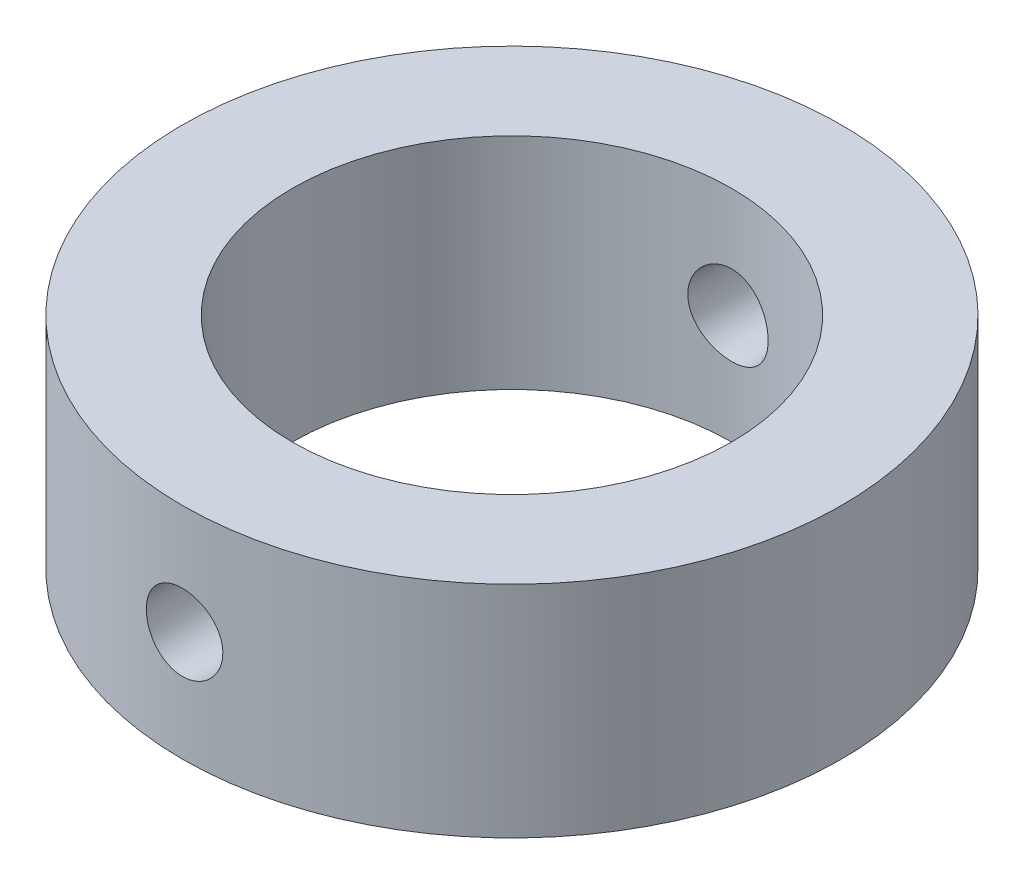
ISO-10303-21;
HEADER;
FILE_DESCRIPTION(('STEP AP214'),'2;1');
FILE_NAME('part.step','',(''),(''),'','','');
FILE_SCHEMA(('AUTOMOTIVE_DESIGN { 1 0 10303 214 1 1 1 1 }'));
ENDSEC;
DATA;
#1=APPLICATION_CONTEXT('core data for automotive mechanical design processes');
#2=APPLICATION_PROTOCOL_DEFINITION('international standard','automotive_design',2000,#1);
#3=PRODUCT_CONTEXT('',#1,'mechanical');
#4=PRODUCT('Part','Part','',(#3));
#5=PRODUCT_RELATED_PRODUCT_CATEGORY('part','',(#4));
#6=PRODUCT_DEFINITION_FORMATION('','',#4);
#7=PRODUCT_DEFINITION_CONTEXT('part definition',#1,'design');
#8=PRODUCT_DEFINITION('design','',#6,#7);
#9=PRODUCT_DEFINITION_SHAPE('','',#8);
#10=(LENGTH_UNIT() NAMED_UNIT(*) SI_UNIT(.MILLI.,.METRE.));
#11=(NAMED_UNIT(*) PLANE_ANGLE_UNIT() SI_UNIT($,.RADIAN.));
#12=(NAMED_UNIT(*) SI_UNIT($,.STERADIAN.) SOLID_ANGLE_UNIT());
#13=UNCERTAINTY_MEASURE_WITH_UNIT(LENGTH_MEASURE(1.E-05),#10,'distance_accuracy_value','');
#14=(GEOMETRIC_REPRESENTATION_CONTEXT(3) GLOBAL_UNCERTAINTY_ASSIGNED_CONTEXT((#13)) GLOBAL_UNIT_ASSIGNED_CONTEXT((#10,
#11,#12)) REPRESENTATION_CONTEXT('',''));
#15=CARTESIAN_POINT('',(0.,0.,0.));
#16=DIRECTION('',(0.,0.,1.));
#17=DIRECTION('',(1.,0.,0.));
#18=AXIS2_PLACEMENT_3D('',#15,#16,#17);
#19=CARTESIAN_POINT('',(0.,10.,0.));
#20=DIRECTION('',(0.,-1.,0.));
#21=DIRECTION('',(0.,0.,-1.));
#22=AXIS2_PLACEMENT_3D('',#19,#20,#21);
#23=CYLINDRICAL_SURFACE('',#22,15.);
#24=CARTESIAN_POINT('',(-1.25139295982516,3.79234175910093,-14.9477093783663));
#25=CARTESIAN_POINT('',(-1.18348361730633,3.72212170808379,-14.9533941423082));
#26=CARTESIAN_POINT('',(-1.10960235790619,3.6575922402065,-14.959111755429));
#27=CARTESIAN_POINT('',(-0.951974794354079,3.54178217258282,-14.9699694142824));
#28=CARTESIAN_POINT('',(-0.868218042358172,3.49051579105574,-14.9751088368794));
#29=CARTESIAN_POINT('',(-0.693247842293825,3.40275674603921,-14.9842273422935));
#30=CARTESIAN_POINT('',(-0.602036163469136,3.3662605893661,-14.9882066994057));
#31=CARTESIAN_POINT('',(-0.414751314196763,3.30909945416944,-14.9945574031471));
#32=CARTESIAN_POINT('',(-0.318679383136366,3.28843046112193,-14.9969291575235));
#33=CARTESIAN_POINT('',(-0.124759031234632,3.26356199226369,-14.9997933721163));
#34=CARTESIAN_POINT('',(-0.0269184568573645,3.25930213639594,-15.0002927219653));
#35=CARTESIAN_POINT('',(0.16808929344199,3.26721159114971,-14.9993751227787));
#36=CARTESIAN_POINT('',(0.265256456118352,3.27938122401569,-14.9979581361564));
#37=CARTESIAN_POINT('',(0.455867685818328,3.31973244627101,-14.9933736118058));
#38=CARTESIAN_POINT('',(0.549321687730372,3.34786772715315,-14.9902111376025));
#39=CARTESIAN_POINT('',(0.730179766945123,3.41930303345223,-14.9824910433732));
#40=CARTESIAN_POINT('',(0.817583693993111,3.46260343533601,-14.9779333887128));
#41=CARTESIAN_POINT('',(0.984231942669029,3.56333708096608,-14.9679087365019));
#42=CARTESIAN_POINT('',(1.06344352003794,3.62082414781445,-14.9624383021489));
#43=CARTESIAN_POINT('',(1.21111707847543,3.74823462943925,-14.951210323341));
#44=CARTESIAN_POINT('',(1.27957874220067,3.81815841122443,-14.9454527704169));
#45=CARTESIAN_POINT('',(1.40410151674721,3.96882162024619,-14.9342704617429));
#46=CARTESIAN_POINT('',(1.46010888833959,4.04960559371394,-14.9288472185055));
#47=CARTESIAN_POINT('',(1.55774721151655,4.21949419344744,-14.9189758942557));
#48=CARTESIAN_POINT('',(1.59937843598775,4.30859866173358,-14.9145277947339));
#49=CARTESIAN_POINT('',(1.66694770508925,4.49233378848272,-14.9071273153428));
#50=CARTESIAN_POINT('',(1.69293157765381,4.58694741024729,-14.9041705717653));
#51=CARTESIAN_POINT('',(1.72862325500614,4.77923330987449,-14.9000734640334));
#52=CARTESIAN_POINT('',(1.73833182037575,4.8769054445886,-14.8989330149997));
#53=CARTESIAN_POINT('',(1.74117284808901,5.07183886272726,-14.8986012331248));
#54=CARTESIAN_POINT('',(1.73441556498063,5.16909853447988,-14.8993969358513));
#55=CARTESIAN_POINT('',(1.70475746381206,5.36108970975458,-14.9028192383814));
#56=CARTESIAN_POINT('',(1.68185671328854,5.45582122385157,-14.9054458305255));
#57=CARTESIAN_POINT('',(1.62060790126855,5.64001650606758,-14.9122289191979));
#58=CARTESIAN_POINT('',(1.58227054612305,5.72948387604308,-14.9163843551955));
#59=CARTESIAN_POINT('',(1.49125204534761,5.90073691298411,-14.9257579755586));
#60=CARTESIAN_POINT('',(1.43857032350961,5.98252227118844,-14.9309762026139));
#61=CARTESIAN_POINT('',(1.31997142180831,6.13664566492841,-14.9419287020573));
#62=CARTESIAN_POINT('',(1.25397289961079,6.20892089469088,-14.9476660202061));
#63=CARTESIAN_POINT('',(1.11079906305098,6.34140862329275,-14.9589863094882));
#64=CARTESIAN_POINT('',(1.03362345146268,6.40162080124472,-14.9645692765121));
#65=CARTESIAN_POINT('',(0.869904556181986,6.5085191472905,-14.974979503484));
#66=CARTESIAN_POINT('',(0.783323829486855,6.55514831204156,-14.9798035406217));
#67=CARTESIAN_POINT('',(0.603502076418399,6.63320584636191,-14.988124547744));
#68=CARTESIAN_POINT('',(0.510261214407792,6.66463459090741,-14.9916215504644));
#69=CARTESIAN_POINT('',(0.320094647848075,6.71129490261493,-14.9968847357431));
#70=CARTESIAN_POINT('',(0.223182331271785,6.72658036779918,-14.9986566762557));
#71=CARTESIAN_POINT('',(0.0281521221882949,6.74068866480036,-15.0002904884823));
#72=CARTESIAN_POINT('',(-0.0699657338356353,6.73951199359127,-15.0001524178573));
#73=CARTESIAN_POINT('',(-0.264148103670457,6.72077552612079,-14.9979869929609));
#74=CARTESIAN_POINT('',(-0.360219946569306,6.70329054732366,-14.9959682666052));
#75=CARTESIAN_POINT('',(-0.548054285042728,6.65255550994882,-14.9902792132202));
#76=CARTESIAN_POINT('',(-0.639816726227135,6.61930525245185,-14.9866088653515));
#77=CARTESIAN_POINT('',(-0.816621649027737,6.53792082135768,-14.9780167341074));
#78=CARTESIAN_POINT('',(-0.901651652460339,6.48975978658742,-14.9730926951241));
#79=CARTESIAN_POINT('',(-1.06244337638185,6.37993338561684,-14.9625437725082));
#80=CARTESIAN_POINT('',(-1.13820473714439,6.31826749553701,-14.9569188616911));
#81=CARTESIAN_POINT('',(-1.27872233792701,6.1827917076007,-14.9455637068463));
#82=CARTESIAN_POINT('',(-1.34341904597503,6.10892007797831,-14.9398330661667));
#83=CARTESIAN_POINT('',(-1.45949320861428,5.95132491462382,-14.9289413127772));
#84=CARTESIAN_POINT('',(-1.51087064696238,5.86760136887729,-14.9237802007618));
#85=CARTESIAN_POINT('',(-1.598817721295,5.69267241777389,-14.9146151690913));
#86=CARTESIAN_POINT('',(-1.63539104756275,5.60146888381067,-14.9106109611211));
#87=CARTESIAN_POINT('',(-1.69266858688715,5.41415783089962,-14.9042178844545));
#88=CARTESIAN_POINT('',(-1.71337406162808,5.31805070249455,-14.9018288873311));
#89=CARTESIAN_POINT('',(-1.73821662730021,5.12433738632427,-14.8989516677065));
#90=CARTESIAN_POINT('',(-1.74246223611426,5.02674529041029,-14.8984509963019));
#91=CARTESIAN_POINT('',(-1.73455547426127,4.83221556777059,-14.8993735525888));
#92=CARTESIAN_POINT('',(-1.72239995165834,4.73527807044268,-14.9007971500824));
#93=CARTESIAN_POINT('',(-1.68211758918857,4.54514724373548,-14.9053978494331));
#94=CARTESIAN_POINT('',(-1.65403991262629,4.45194333009076,-14.9085695527698));
#95=CARTESIAN_POINT('',(-1.58278228057826,4.27163951697975,-14.9163023191482));
#96=CARTESIAN_POINT('',(-1.53961764849423,4.18453353135842,-14.9208619718838));
#97=CARTESIAN_POINT('',(-1.45582105008805,4.04585353510098,-14.9292238727328));
#98=CARTESIAN_POINT('',(-1.41895050934156,3.99195313575082,-14.9327884781705));
#99=CARTESIAN_POINT('',(-1.33940488728118,3.88863695862405,-14.9401336339009));
#100=CARTESIAN_POINT('',(-1.29672976569968,3.83922121196238,-14.9439141856915));
#101=CARTESIAN_POINT('',(-1.25139295982516,3.79234175910093,-14.9477093783663));
#102=B_SPLINE_CURVE_WITH_KNOTS('',3,(#24,#25,#26,#27,#28,#29,#30,#31,#32,#33,#34,#35,#36,#37,
#38,#39,#40,#41,#42,#43,#44,#45,#46,#47,#48,#49,#50,#51,#52,#53,#54,#55,#56,#57,#58,#59,#60,#61,
#62,#63,#64,#65,#66,#67,#68,#69,#70,#71,#72,#73,#74,#75,#76,#77,#78,#79,#80,#81,#82,#83,#84,#85,
#86,#87,#88,#89,#90,#91,#92,#93,#94,#95,#96,#97,#98,#99,#100,#101),.UNSPECIFIED.,.T.,.F.,(4,2,2,
2,2,2,2,2,2,2,2,2,2,2,2,2,2,2,2,2,2,2,2,2,2,2,2,2,2,2,2,2,2,2,2,2,2,2,4),(0.,0.293316909855174,
0.586946968764636,0.880507543020068,1.17399363161817,1.4663987535875,1.75880961081172,
2.05037663139753,2.3419508905076,2.63464884055526,2.92735542958346,3.22130151853812,
3.51524202752979,3.8083174033038,4.10137908262223,4.39248383339477,4.68358736632918,
4.97448934568743,5.26540301219817,5.558150589215,5.85090595253263,6.14487277299274,
6.43883234127234,6.73180732543656,7.02477346502405,7.31640214310492,7.60803450092443,
7.90019531018905,8.19236745494599,8.486065255112,8.77976341344675,9.073388315255,
9.36698986794301,9.6586524165134,9.95037102418017,10.2411937503675,10.5317219502416,
10.727541244806,10.9233618978793),.UNSPECIFIED.);
#103=CARTESIAN_POINT('',(-1.25139295982516,3.79234175910093,-14.9477093783663));
#104=VERTEX_POINT('',#103);
#105=EDGE_CURVE('E69',#104,#104,#102,.T.);
#106=ORIENTED_EDGE('',*,*,#105,.T.);
#107=EDGE_LOOP('',(#106));
#108=FACE_BOUND('',#107,.T.);
#109=CARTESIAN_POINT('',(0.,10.,0.));
#110=DIRECTION('',(0.,1.,0.));
#111=DIRECTION('',(0.,0.,1.));
#112=AXIS2_PLACEMENT_3D('',#109,#110,#111);
#113=CIRCLE('',#112,15.);
#114=CARTESIAN_POINT('',(0.,10.,15.));
#115=VERTEX_POINT('',#114);
#116=EDGE_CURVE('E10',#115,#115,#113,.T.);
#117=ORIENTED_EDGE('',*,*,#116,.F.);
#118=EDGE_LOOP('',(#117));
#119=FACE_BOUND('',#118,.T.);
#120=CARTESIAN_POINT('',(0.,0.,0.));
#121=DIRECTION('',(0.,1.,0.));
#122=DIRECTION('',(0.,0.,1.));
#123=AXIS2_PLACEMENT_3D('',#120,#121,#122);
#124=CIRCLE('',#123,15.);
#125=CARTESIAN_POINT('',(0.,0.,15.));
#126=VERTEX_POINT('',#125);
#127=EDGE_CURVE('E51',#126,#126,#124,.T.);
#128=ORIENTED_EDGE('',*,*,#127,.T.);
#129=EDGE_LOOP('',(#128));
#130=FACE_BOUND('',#129,.T.);
#131=CARTESIAN_POINT('',(-1.25139295982516,3.79234175910093,14.9477093783663));
#132=CARTESIAN_POINT('',(-1.18348361730633,3.72212170808379,14.9533941423082));
#133=CARTESIAN_POINT('',(-1.10960235790619,3.6575922402065,14.959111755429));
#134=CARTESIAN_POINT('',(-0.951974794354079,3.54178217258282,14.9699694142824));
#135=CARTESIAN_POINT('',(-0.868218042358172,3.49051579105574,14.9751088368794));
#136=CARTESIAN_POINT('',(-0.693247842293825,3.40275674603921,14.9842273422935));
#137=CARTESIAN_POINT('',(-0.602036163469136,3.3662605893661,14.9882066994057));
#138=CARTESIAN_POINT('',(-0.414751314196763,3.30909945416944,14.9945574031471));
#139=CARTESIAN_POINT('',(-0.318679383136366,3.28843046112193,14.9969291575235));
#140=CARTESIAN_POINT('',(-0.124759031234632,3.26356199226369,14.9997933721163));
#141=CARTESIAN_POINT('',(-0.0269184568573645,3.25930213639594,15.0002927219653));
#142=CARTESIAN_POINT('',(0.16808929344199,3.26721159114971,14.9993751227787));
#143=CARTESIAN_POINT('',(0.265256456118352,3.27938122401569,14.9979581361564));
#144=CARTESIAN_POINT('',(0.455867685818328,3.31973244627101,14.9933736118058));
#145=CARTESIAN_POINT('',(0.549321687730372,3.34786772715315,14.9902111376025));
#146=CARTESIAN_POINT('',(0.730179766945123,3.41930303345223,14.9824910433732));
#147=CARTESIAN_POINT('',(0.817583693993111,3.46260343533601,14.9779333887128));
#148=CARTESIAN_POINT('',(0.984231942669029,3.56333708096608,14.9679087365019));
#149=CARTESIAN_POINT('',(1.06344352003794,3.62082414781445,14.9624383021489));
#150=CARTESIAN_POINT('',(1.21111707847543,3.74823462943925,14.951210323341));
#151=CARTESIAN_POINT('',(1.27957874220067,3.81815841122443,14.9454527704169));
#152=CARTESIAN_POINT('',(1.40410151674721,3.96882162024619,14.9342704617429));
#153=CARTESIAN_POINT('',(1.46010888833959,4.04960559371394,14.9288472185055));
#154=CARTESIAN_POINT('',(1.55774721151655,4.21949419344744,14.9189758942557));
#155=CARTESIAN_POINT('',(1.59937843598775,4.30859866173358,14.9145277947339));
#156=CARTESIAN_POINT('',(1.66694770508925,4.49233378848272,14.9071273153428));
#157=CARTESIAN_POINT('',(1.69293157765381,4.58694741024729,14.9041705717653));
#158=CARTESIAN_POINT('',(1.72862325500614,4.77923330987449,14.9000734640334));
#159=CARTESIAN_POINT('',(1.73833182037575,4.8769054445886,14.8989330149997));
#160=CARTESIAN_POINT('',(1.74117284808901,5.07183886272726,14.8986012331248));
#161=CARTESIAN_POINT('',(1.73441556498063,5.16909853447988,14.8993969358513));
#162=CARTESIAN_POINT('',(1.70475746381206,5.36108970975458,14.9028192383814));
#163=CARTESIAN_POINT('',(1.68185671328854,5.45582122385157,14.9054458305255));
#164=CARTESIAN_POINT('',(1.62060790126855,5.64001650606758,14.9122289191979));
#165=CARTESIAN_POINT('',(1.58227054612305,5.72948387604308,14.9163843551955));
#166=CARTESIAN_POINT('',(1.49125204534761,5.90073691298411,14.9257579755586));
#167=CARTESIAN_POINT('',(1.43857032350961,5.98252227118844,14.9309762026139));
#168=CARTESIAN_POINT('',(1.31997142180831,6.13664566492841,14.9419287020573));
#169=CARTESIAN_POINT('',(1.25397289961079,6.20892089469088,14.9476660202061));
#170=CARTESIAN_POINT('',(1.11079906305098,6.34140862329275,14.9589863094882));
#171=CARTESIAN_POINT('',(1.03362345146268,6.40162080124472,14.9645692765121));
#172=CARTESIAN_POINT('',(0.869904556181986,6.5085191472905,14.974979503484));
#173=CARTESIAN_POINT('',(0.783323829486855,6.55514831204156,14.9798035406217));
#174=CARTESIAN_POINT('',(0.603502076418399,6.63320584636191,14.988124547744));
#175=CARTESIAN_POINT('',(0.510261214407792,6.66463459090741,14.9916215504644));
#176=CARTESIAN_POINT('',(0.320094647848075,6.71129490261493,14.9968847357431));
#177=CARTESIAN_POINT('',(0.223182331271785,6.72658036779918,14.9986566762557));
#178=CARTESIAN_POINT('',(0.0281521221882949,6.74068866480036,15.0002904884823));
#179=CARTESIAN_POINT('',(-0.0699657338356353,6.73951199359127,15.0001524178573));
#180=CARTESIAN_POINT('',(-0.264148103670457,6.72077552612079,14.9979869929609));
#181=CARTESIAN_POINT('',(-0.360219946569306,6.70329054732366,14.9959682666052));
#182=CARTESIAN_POINT('',(-0.548054285042728,6.65255550994882,14.9902792132202));
#183=CARTESIAN_POINT('',(-0.639816726227135,6.61930525245185,14.9866088653515));
#184=CARTESIAN_POINT('',(-0.816621649027737,6.53792082135768,14.9780167341074));
#185=CARTESIAN_POINT('',(-0.901651652460339,6.48975978658742,14.9730926951241));
#186=CARTESIAN_POINT('',(-1.06244337638185,6.37993338561684,14.9625437725082));
#187=CARTESIAN_POINT('',(-1.13820473714439,6.31826749553701,14.9569188616911));
#188=CARTESIAN_POINT('',(-1.27872233792701,6.1827917076007,14.9455637068463));
#189=CARTESIAN_POINT('',(-1.34341904597503,6.10892007797831,14.9398330661667));
#190=CARTESIAN_POINT('',(-1.45949320861428,5.95132491462382,14.9289413127772));
#191=CARTESIAN_POINT('',(-1.51087064696238,5.86760136887729,14.9237802007618));
#192=CARTESIAN_POINT('',(-1.598817721295,5.69267241777389,14.9146151690913));
#193=CARTESIAN_POINT('',(-1.63539104756275,5.60146888381067,14.9106109611211));
#194=CARTESIAN_POINT('',(-1.69266858688715,5.41415783089962,14.9042178844545));
#195=CARTESIAN_POINT('',(-1.71337406162808,5.31805070249455,14.9018288873311));
#196=CARTESIAN_POINT('',(-1.73821662730021,5.12433738632427,14.8989516677065));
#197=CARTESIAN_POINT('',(-1.74246223611426,5.02674529041029,14.8984509963019));
#198=CARTESIAN_POINT('',(-1.73455547426127,4.83221556777059,14.8993735525888));
#199=CARTESIAN_POINT('',(-1.72239995165834,4.73527807044268,14.9007971500824));
#200=CARTESIAN_POINT('',(-1.68211758918857,4.54514724373548,14.9053978494331));
#201=CARTESIAN_POINT('',(-1.65403991262629,4.45194333009076,14.9085695527698));
#202=CARTESIAN_POINT('',(-1.58278228057826,4.27163951697975,14.9163023191482));
#203=CARTESIAN_POINT('',(-1.53961764849423,4.18453353135842,14.9208619718838));
#204=CARTESIAN_POINT('',(-1.45582105008805,4.04585353510098,14.9292238727328));
#205=CARTESIAN_POINT('',(-1.41895050934156,3.99195313575082,14.9327884781705));
#206=CARTESIAN_POINT('',(-1.33940488728118,3.88863695862405,14.9401336339009));
#207=CARTESIAN_POINT('',(-1.29672976569968,3.83922121196238,14.9439141856915));
#208=CARTESIAN_POINT('',(-1.25139295982516,3.79234175910093,14.9477093783663));
#209=B_SPLINE_CURVE_WITH_KNOTS('',3,(#131,#132,#133,#134,#135,#136,#137,#138,#139,#140,#141,
#142,#143,#144,#145,#146,#147,#148,#149,#150,#151,#152,#153,#154,#155,#156,#157,#158,#159,#160,
#161,#162,#163,#164,#165,#166,#167,#168,#169,#170,#171,#172,#173,#174,#175,#176,#177,#178,#179,
#180,#181,#182,#183,#184,#185,#186,#187,#188,#189,#190,#191,#192,#193,#194,#195,#196,#197,#198,
#199,#200,#201,#202,#203,#204,#205,#206,#207,#208),.UNSPECIFIED.,.T.,.F.,(4,2,2,2,2,2,2,2,2,2,2,
2,2,2,2,2,2,2,2,2,2,2,2,2,2,2,2,2,2,2,2,2,2,2,2,2,2,2,4),(0.,0.293316909855174,
0.586946968764636,0.880507543020068,1.17399363161817,1.4663987535875,1.75880961081172,
2.05037663139753,2.3419508905076,2.63464884055526,2.92735542958346,3.22130151853812,
3.51524202752979,3.8083174033038,4.10137908262223,4.39248383339477,4.68358736632918,
4.97448934568743,5.26540301219817,5.558150589215,5.85090595253263,6.14487277299274,
6.43883234127234,6.73180732543656,7.02477346502405,7.31640214310492,7.60803450092443,
7.90019531018905,8.19236745494599,8.486065255112,8.77976341344675,9.073388315255,
9.36698986794301,9.6586524165134,9.95037102418017,10.2411937503675,10.5317219502416,
10.727541244806,10.9233618978793),.UNSPECIFIED.);
#210=CARTESIAN_POINT('',(-1.25139295982516,3.79234175910093,14.9477093783663));
#211=VERTEX_POINT('',#210);
#212=EDGE_CURVE('E88',#211,#211,#209,.T.);
#213=ORIENTED_EDGE('',*,*,#212,.F.);
#214=EDGE_LOOP('',(#213));
#215=FACE_BOUND('',#214,.T.);
#216=ADVANCED_FACE('F37',(#108,#119,#130,#215),#23,.T.);
#217=CARTESIAN_POINT('',(0.,10.,0.));
#218=DIRECTION('',(0.,-1.,0.));
#219=DIRECTION('',(0.,0.,-1.));
#220=AXIS2_PLACEMENT_3D('',#217,#218,#219);
#221=CYLINDRICAL_SURFACE('',#220,10.);
#222=CARTESIAN_POINT('',(0.,0.,0.));
#223=DIRECTION('',(0.,1.,0.));
#224=DIRECTION('',(0.,0.,1.));
#225=AXIS2_PLACEMENT_3D('',#222,#223,#224);
#226=CIRCLE('',#225,10.);
#227=CARTESIAN_POINT('',(0.,0.,10.));
#228=VERTEX_POINT('',#227);
#229=EDGE_CURVE('E60',#228,#228,#226,.T.);
#230=ORIENTED_EDGE('',*,*,#229,.F.);
#231=EDGE_LOOP('',(#230));
#232=FACE_BOUND('',#231,.T.);
#233=CARTESIAN_POINT('',(0.,10.,0.));
#234=DIRECTION('',(0.,1.,0.));
#235=DIRECTION('',(0.,0.,1.));
#236=AXIS2_PLACEMENT_3D('',#233,#234,#235);
#237=CIRCLE('',#236,10.);
#238=CARTESIAN_POINT('',(0.,10.,10.));
#239=VERTEX_POINT('',#238);
#240=EDGE_CURVE('E57',#239,#239,#237,.T.);
#241=ORIENTED_EDGE('',*,*,#240,.T.);
#242=EDGE_LOOP('',(#241));
#243=FACE_BOUND('',#242,.T.);
#244=CARTESIAN_POINT('',(-1.3345414330707,3.75221504611304,-9.91054989208054));
#245=CARTESIAN_POINT('',(-1.26434001160468,3.67737931838805,-9.92000238711793));
#246=CARTESIAN_POINT('',(-1.18779034601462,3.60843754104146,-9.92954876533397));
#247=CARTESIAN_POINT('',(-1.0240968005732,3.48428570760716,-9.94776381112325));
#248=CARTESIAN_POINT('',(-0.936943837154803,3.42908755039092,-9.95643171431279));
#249=CARTESIAN_POINT('',(-0.754455787617089,3.33403708508488,-9.9719191282984));
#250=CARTESIAN_POINT('',(-0.659119581179458,3.29418688230148,-9.97873838547442));
#251=CARTESIAN_POINT('',(-0.462988382117305,3.23105406001255,-9.98975864671353));
#252=CARTESIAN_POINT('',(-0.362194838782022,3.20776706486175,-9.993960342244));
#253=CARTESIAN_POINT('',(-0.159027842962661,3.17861217094757,-9.99924670221558));
#254=CARTESIAN_POINT('',(-0.0566788667817974,3.17257909823512,-10.0003609202364));
#255=CARTESIAN_POINT('',(0.147578727369162,3.17765037861649,-9.9994325090812));
#256=CARTESIAN_POINT('',(0.249487351663036,3.18875448478203,-9.99738992539121));
#257=CARTESIAN_POINT('',(0.44912878317679,3.22759470702044,-9.99040475090429));
#258=CARTESIAN_POINT('',(0.5468883886207,3.25519762459616,-9.98548539175123));
#259=CARTESIAN_POINT('',(0.736382128264922,3.32609922377935,-9.97330256701339));
#260=CARTESIAN_POINT('',(0.828115923193309,3.3693987882638,-9.9660389695766));
#261=CARTESIAN_POINT('',(1.00387674975945,3.47092026837859,-9.9498793785978));
#262=CARTESIAN_POINT('',(1.08782626942956,3.52927406598134,-9.94096916632972));
#263=CARTESIAN_POINT('',(1.24481286212879,3.65909677146714,-9.9225349225076));
#264=CARTESIAN_POINT('',(1.3178490063124,3.73056679452974,-9.91301083880512));
#265=CARTESIAN_POINT('',(1.45182388466178,3.88562383279582,-9.89428359991917));
#266=CARTESIAN_POINT('',(1.5126083464185,3.96934489718785,-9.88508561132625));
#267=CARTESIAN_POINT('',(1.61923395647637,4.14595603094304,-9.86818155637203));
#268=CARTESIAN_POINT('',(1.6650756238825,4.23884578164467,-9.8604754381877));
#269=CARTESIAN_POINT('',(1.74024272498875,4.43069729101442,-9.84748759415155));
#270=CARTESIAN_POINT('',(1.76965163886854,4.52962547396235,-9.84219364006158));
#271=CARTESIAN_POINT('',(1.81138245581335,4.73113049044606,-9.83459966678573));
#272=CARTESIAN_POINT('',(1.82370637538496,4.83370689192411,-9.83229929427557));
#273=CARTESIAN_POINT('',(1.83081226950608,5.03780775498549,-9.830978497407));
#274=CARTESIAN_POINT('',(1.8258766879674,5.13932213845931,-9.83190526136557));
#275=CARTESIAN_POINT('',(1.79924693395261,5.34004875773206,-9.83681301798227));
#276=CARTESIAN_POINT('',(1.77755301604938,5.43926102847839,-9.84079396424485));
#277=CARTESIAN_POINT('',(1.71817327838287,5.63229266014097,-9.85133384700967));
#278=CARTESIAN_POINT('',(1.68053628718216,5.72612750239389,-9.85788490758253));
#279=CARTESIAN_POINT('',(1.59038504092085,5.90619553366153,-9.87282906007024));
#280=CARTESIAN_POINT('',(1.53786943836437,5.99242803323482,-9.88122231881002));
#281=CARTESIAN_POINT('',(1.4185469681406,6.15621896056284,-9.89906085628549));
#282=CARTESIAN_POINT('',(1.35154060739489,6.233630577078,-9.90851983398097));
#283=CARTESIAN_POINT('',(1.20555149087414,6.3762104007564,-9.92733860479846));
#284=CARTESIAN_POINT('',(1.12656788847826,6.44137774169362,-9.93669839085895));
#285=CARTESIAN_POINT('',(0.957859063552199,6.5583076183189,-9.95438415454675));
#286=CARTESIAN_POINT('',(0.86802852948139,6.60992021068082,-9.9626980779503));
#287=CARTESIAN_POINT('',(0.680813747773548,6.69731507849826,-9.97723892305915));
#288=CARTESIAN_POINT('',(0.583429950119667,6.7330982961334,-9.98346596897207));
#289=CARTESIAN_POINT('',(0.384687640415487,6.78752645874405,-9.99308901587484));
#290=CARTESIAN_POINT('',(0.283367152566918,6.80630620158107,-9.99650726369329));
#291=CARTESIAN_POINT('',(0.0789589128839737,6.82662642796168,-10.0002104625573));
#292=CARTESIAN_POINT('',(-0.0241286920404458,6.82816833768444,-10.000495672816));
#293=CARTESIAN_POINT('',(-0.227795900800379,6.81405613636651,-9.99791765110976));
#294=CARTESIAN_POINT('',(-0.328390756219346,6.79861370231079,-9.99509317492405));
#295=CARTESIAN_POINT('',(-0.525530205804137,6.75134473322009,-9.98666898440008));
#296=CARTESIAN_POINT('',(-0.622074714367127,6.71951785209332,-9.98106921143881));
#297=CARTESIAN_POINT('',(-0.808737062156857,6.64029931470559,-9.96768457918682));
#298=CARTESIAN_POINT('',(-0.898834045338809,6.59285970129846,-9.95989299823522));
#299=CARTESIAN_POINT('',(-1.06984524588666,6.48378544858847,-9.94297870041879));
#300=CARTESIAN_POINT('',(-1.15075859714424,6.42214947208441,-9.93385585818785));
#301=CARTESIAN_POINT('',(-1.30227384189784,6.28542287592789,-9.91513991517711));
#302=CARTESIAN_POINT('',(-1.37271966325886,6.21015985449018,-9.90554209083863));
#303=CARTESIAN_POINT('',(-1.50000643314238,6.04881151480954,-9.88706877232799));
#304=CARTESIAN_POINT('',(-1.55684707438102,5.96272595219783,-9.87819329447359));
#305=CARTESIAN_POINT('',(-1.6553994512315,5.78187923592328,-9.86215807834705));
#306=CARTESIAN_POINT('',(-1.6970765057771,5.68709880773129,-9.85500228573734));
#307=CARTESIAN_POINT('',(-1.76383931337243,5.49171693001089,-9.84327331689999));
#308=CARTESIAN_POINT('',(-1.78892732938162,5.39111627647345,-9.83869978843056));
#309=CARTESIAN_POINT('',(-1.82146928540086,5.18854792067412,-9.83272711071381));
#310=CARTESIAN_POINT('',(-1.82917992710476,5.08662279876999,-9.83128176426829));
#311=CARTESIAN_POINT('',(-1.82747626584029,4.88290650837314,-9.83159863260272));
#312=CARTESIAN_POINT('',(-1.81806022532119,4.78111535452032,-9.83336117283192));
#313=CARTESIAN_POINT('',(-1.78258616096536,4.58163244803055,-9.83985274262039));
#314=CARTESIAN_POINT('',(-1.7566940645752,4.48391005706706,-9.84455218678868));
#315=CARTESIAN_POINT('',(-1.68922188252381,4.29425831545457,-9.85635295379691));
#316=CARTESIAN_POINT('',(-1.64765351211854,4.20232469844102,-9.86345248258664));
#317=CARTESIAN_POINT('',(-1.56244891680455,4.04895786631759,-9.87725182824322));
#318=CARTESIAN_POINT('',(-1.52200106487899,3.98569572043168,-9.88359772261684));
#319=CARTESIAN_POINT('',(-1.43367767832994,3.86464644984659,-9.89679568029343));
#320=CARTESIAN_POINT('',(-1.38580193423159,3.80685947962752,-9.90364775786846));
#321=CARTESIAN_POINT('',(-1.3345414330707,3.75221504611304,-9.91054989208054));
#322=B_SPLINE_CURVE_WITH_KNOTS('',3,(#244,#245,#246,#247,#248,#249,#250,#251,#252,#253,#254,
#255,#256,#257,#258,#259,#260,#261,#262,#263,#264,#265,#266,#267,#268,#269,#270,#271,#272,#273,
#274,#275,#276,#277,#278,#279,#280,#281,#282,#283,#284,#285,#286,#287,#288,#289,#290,#291,#292,
#293,#294,#295,#296,#297,#298,#299,#300,#301,#302,#303,#304,#305,#306,#307,#308,#309,#310,#311,
#312,#313,#314,#315,#316,#317,#318,#319,#320,#321),.UNSPECIFIED.,.T.,.F.,(4,2,2,2,2,2,2,2,2,2,2,
2,2,2,2,2,2,2,2,2,2,2,2,2,2,2,2,2,2,2,2,2,2,2,2,2,2,2,4),(0.,0.308861145648771,
0.617988772689952,0.927158788231696,1.23624709729979,1.54236639654866,1.84848128498957,
2.15215760265528,2.45585100361548,2.76230101508982,3.06877709391464,3.37889958641533,
3.68901130427173,3.99753295470687,4.30601818786768,4.60947898931162,4.9129351810277,
5.21546862700742,5.51802948098544,5.82505601273617,6.13210425702604,6.4424182206664,
6.7527137116349,7.06052717946616,7.36831518003565,7.67231022709796,7.97631169576865,
8.28125581032667,8.58622866030916,8.89537035079486,9.20451902283388,9.51437037764782,
9.82417945600392,10.1293811162621,10.4346137418255,10.7368200490768,11.0388009564149,
11.264322466167,11.4898503370341),.UNSPECIFIED.);
#323=CARTESIAN_POINT('',(-1.3345414330707,3.75221504611304,-9.91054989208054));
#324=VERTEX_POINT('',#323);
#325=EDGE_CURVE('E62',#324,#324,#322,.T.);
#326=ORIENTED_EDGE('',*,*,#325,.F.);
#327=EDGE_LOOP('',(#326));
#328=FACE_BOUND('',#327,.T.);
#329=CARTESIAN_POINT('',(-1.3345414330707,3.75221504611304,9.91054989208054));
#330=CARTESIAN_POINT('',(-1.26434001160468,3.67737931838805,9.92000238711793));
#331=CARTESIAN_POINT('',(-1.18779034601462,3.60843754104146,9.92954876533397));
#332=CARTESIAN_POINT('',(-1.0240968005732,3.48428570760716,9.94776381112325));
#333=CARTESIAN_POINT('',(-0.936943837154803,3.42908755039092,9.95643171431279));
#334=CARTESIAN_POINT('',(-0.754455787617089,3.33403708508488,9.9719191282984));
#335=CARTESIAN_POINT('',(-0.659119581179458,3.29418688230148,9.97873838547442));
#336=CARTESIAN_POINT('',(-0.462988382117305,3.23105406001255,9.98975864671353));
#337=CARTESIAN_POINT('',(-0.362194838782022,3.20776706486175,9.993960342244));
#338=CARTESIAN_POINT('',(-0.159027842962661,3.17861217094757,9.99924670221558));
#339=CARTESIAN_POINT('',(-0.0566788667817974,3.17257909823512,10.0003609202364));
#340=CARTESIAN_POINT('',(0.147578727369162,3.17765037861649,9.9994325090812));
#341=CARTESIAN_POINT('',(0.249487351663036,3.18875448478203,9.99738992539121));
#342=CARTESIAN_POINT('',(0.44912878317679,3.22759470702044,9.99040475090429));
#343=CARTESIAN_POINT('',(0.5468883886207,3.25519762459616,9.98548539175123));
#344=CARTESIAN_POINT('',(0.736382128264922,3.32609922377935,9.97330256701339));
#345=CARTESIAN_POINT('',(0.828115923193309,3.3693987882638,9.9660389695766));
#346=CARTESIAN_POINT('',(1.00387674975945,3.47092026837859,9.9498793785978));
#347=CARTESIAN_POINT('',(1.08782626942956,3.52927406598134,9.94096916632972));
#348=CARTESIAN_POINT('',(1.24481286212879,3.65909677146714,9.9225349225076));
#349=CARTESIAN_POINT('',(1.3178490063124,3.73056679452974,9.91301083880512));
#350=CARTESIAN_POINT('',(1.45182388466178,3.88562383279582,9.89428359991917));
#351=CARTESIAN_POINT('',(1.5126083464185,3.96934489718785,9.88508561132625));
#352=CARTESIAN_POINT('',(1.61923395647637,4.14595603094304,9.86818155637203));
#353=CARTESIAN_POINT('',(1.6650756238825,4.23884578164467,9.8604754381877));
#354=CARTESIAN_POINT('',(1.74024272498875,4.43069729101442,9.84748759415155));
#355=CARTESIAN_POINT('',(1.76965163886854,4.52962547396235,9.84219364006158));
#356=CARTESIAN_POINT('',(1.81138245581335,4.73113049044606,9.83459966678573));
#357=CARTESIAN_POINT('',(1.82370637538496,4.83370689192411,9.83229929427557));
#358=CARTESIAN_POINT('',(1.83081226950608,5.03780775498549,9.830978497407));
#359=CARTESIAN_POINT('',(1.8258766879674,5.13932213845931,9.83190526136557));
#360=CARTESIAN_POINT('',(1.79924693395261,5.34004875773206,9.83681301798227));
#361=CARTESIAN_POINT('',(1.77755301604938,5.43926102847839,9.84079396424485));
#362=CARTESIAN_POINT('',(1.71817327838287,5.63229266014097,9.85133384700967));
#363=CARTESIAN_POINT('',(1.68053628718216,5.72612750239389,9.85788490758253));
#364=CARTESIAN_POINT('',(1.59038504092085,5.90619553366153,9.87282906007024));
#365=CARTESIAN_POINT('',(1.53786943836437,5.99242803323482,9.88122231881002));
#366=CARTESIAN_POINT('',(1.4185469681406,6.15621896056284,9.89906085628549));
#367=CARTESIAN_POINT('',(1.35154060739489,6.233630577078,9.90851983398097));
#368=CARTESIAN_POINT('',(1.20555149087414,6.3762104007564,9.92733860479846));
#369=CARTESIAN_POINT('',(1.12656788847826,6.44137774169362,9.93669839085895));
#370=CARTESIAN_POINT('',(0.957859063552199,6.5583076183189,9.95438415454675));
#371=CARTESIAN_POINT('',(0.86802852948139,6.60992021068082,9.9626980779503));
#372=CARTESIAN_POINT('',(0.680813747773548,6.69731507849826,9.97723892305915));
#373=CARTESIAN_POINT('',(0.583429950119667,6.7330982961334,9.98346596897207));
#374=CARTESIAN_POINT('',(0.384687640415487,6.78752645874405,9.99308901587484));
#375=CARTESIAN_POINT('',(0.283367152566918,6.80630620158107,9.99650726369329));
#376=CARTESIAN_POINT('',(0.0789589128839737,6.82662642796168,10.0002104625573));
#377=CARTESIAN_POINT('',(-0.0241286920404458,6.82816833768444,10.000495672816));
#378=CARTESIAN_POINT('',(-0.227795900800379,6.81405613636651,9.99791765110976));
#379=CARTESIAN_POINT('',(-0.328390756219346,6.79861370231079,9.99509317492405));
#380=CARTESIAN_POINT('',(-0.525530205804137,6.75134473322009,9.98666898440008));
#381=CARTESIAN_POINT('',(-0.622074714367127,6.71951785209332,9.98106921143881));
#382=CARTESIAN_POINT('',(-0.808737062156857,6.64029931470559,9.96768457918682));
#383=CARTESIAN_POINT('',(-0.898834045338809,6.59285970129846,9.95989299823522));
#384=CARTESIAN_POINT('',(-1.06984524588666,6.48378544858847,9.94297870041879));
#385=CARTESIAN_POINT('',(-1.15075859714424,6.42214947208441,9.93385585818785));
#386=CARTESIAN_POINT('',(-1.30227384189784,6.28542287592789,9.91513991517711));
#387=CARTESIAN_POINT('',(-1.37271966325886,6.21015985449018,9.90554209083863));
#388=CARTESIAN_POINT('',(-1.50000643314238,6.04881151480954,9.88706877232799));
#389=CARTESIAN_POINT('',(-1.55684707438102,5.96272595219783,9.87819329447359));
#390=CARTESIAN_POINT('',(-1.6553994512315,5.78187923592328,9.86215807834705));
#391=CARTESIAN_POINT('',(-1.6970765057771,5.68709880773129,9.85500228573734));
#392=CARTESIAN_POINT('',(-1.76383931337243,5.49171693001089,9.84327331689999));
#393=CARTESIAN_POINT('',(-1.78892732938162,5.39111627647345,9.83869978843056));
#394=CARTESIAN_POINT('',(-1.82146928540086,5.18854792067412,9.83272711071381));
#395=CARTESIAN_POINT('',(-1.82917992710476,5.08662279876999,9.83128176426829));
#396=CARTESIAN_POINT('',(-1.82747626584029,4.88290650837314,9.83159863260272));
#397=CARTESIAN_POINT('',(-1.81806022532119,4.78111535452032,9.83336117283192));
#398=CARTESIAN_POINT('',(-1.78258616096536,4.58163244803055,9.83985274262039));
#399=CARTESIAN_POINT('',(-1.7566940645752,4.48391005706706,9.84455218678868));
#400=CARTESIAN_POINT('',(-1.68922188252381,4.29425831545457,9.85635295379691));
#401=CARTESIAN_POINT('',(-1.64765351211854,4.20232469844102,9.86345248258664));
#402=CARTESIAN_POINT('',(-1.56244891680455,4.04895786631759,9.87725182824322));
#403=CARTESIAN_POINT('',(-1.52200106487899,3.98569572043168,9.88359772261684));
#404=CARTESIAN_POINT('',(-1.43367767832994,3.86464644984659,9.89679568029343));
#405=CARTESIAN_POINT('',(-1.38580193423159,3.80685947962752,9.90364775786846));
#406=CARTESIAN_POINT('',(-1.3345414330707,3.75221504611304,9.91054989208054));
#407=B_SPLINE_CURVE_WITH_KNOTS('',3,(#329,#330,#331,#332,#333,#334,#335,#336,#337,#338,#339,
#340,#341,#342,#343,#344,#345,#346,#347,#348,#349,#350,#351,#352,#353,#354,#355,#356,#357,#358,
#359,#360,#361,#362,#363,#364,#365,#366,#367,#368,#369,#370,#371,#372,#373,#374,#375,#376,#377,
#378,#379,#380,#381,#382,#383,#384,#385,#386,#387,#388,#389,#390,#391,#392,#393,#394,#395,#396,
#397,#398,#399,#400,#401,#402,#403,#404,#405,#406),.UNSPECIFIED.,.T.,.F.,(4,2,2,2,2,2,2,2,2,2,2,
2,2,2,2,2,2,2,2,2,2,2,2,2,2,2,2,2,2,2,2,2,2,2,2,2,2,2,4),(0.,0.308861145648771,
0.617988772689952,0.927158788231696,1.23624709729979,1.54236639654866,1.84848128498957,
2.15215760265528,2.45585100361548,2.76230101508982,3.06877709391464,3.37889958641533,
3.68901130427173,3.99753295470687,4.30601818786768,4.60947898931162,4.9129351810277,
5.21546862700742,5.51802948098544,5.82505601273617,6.13210425702604,6.4424182206664,
6.7527137116349,7.06052717946616,7.36831518003565,7.67231022709796,7.97631169576865,
8.28125581032667,8.58622866030916,8.89537035079486,9.20451902283388,9.51437037764782,
9.82417945600392,10.1293811162621,10.4346137418255,10.7368200490768,11.0388009564149,
11.264322466167,11.4898503370341),.UNSPECIFIED.);
#408=CARTESIAN_POINT('',(-1.3345414330707,3.75221504611304,9.91054989208054));
#409=VERTEX_POINT('',#408);
#410=EDGE_CURVE('E41',#409,#409,#407,.T.);
#411=ORIENTED_EDGE('',*,*,#410,.T.);
#412=EDGE_LOOP('',(#411));
#413=FACE_BOUND('',#412,.T.);
#414=ADVANCED_FACE('F70',(#232,#243,#328,#413),#221,.F.);
#415=CARTESIAN_POINT('',(0.,10.,0.));
#416=DIRECTION('',(0.,1.,0.));
#417=DIRECTION('',(0.,0.,1.));
#418=AXIS2_PLACEMENT_3D('',#415,#416,#417);
#419=PLANE('',#418);
#420=ORIENTED_EDGE('',*,*,#116,.T.);
#421=EDGE_LOOP('',(#420));
#422=FACE_BOUND('',#421,.T.);
#423=ORIENTED_EDGE('',*,*,#240,.F.);
#424=EDGE_LOOP('',(#423));
#425=FACE_BOUND('',#424,.T.);
#426=ADVANCED_FACE('F104',(#422,#425),#419,.T.);
#427=CARTESIAN_POINT('',(0.,0.,0.));
#428=DIRECTION('',(0.,1.,0.));
#429=DIRECTION('',(0.,0.,1.));
#430=AXIS2_PLACEMENT_3D('',#427,#428,#429);
#431=PLANE('',#430);
#432=ORIENTED_EDGE('',*,*,#127,.F.);
#433=EDGE_LOOP('',(#432));
#434=FACE_BOUND('',#433,.T.);
#435=ORIENTED_EDGE('',*,*,#229,.T.);
#436=EDGE_LOOP('',(#435));
#437=FACE_BOUND('',#436,.T.);
#438=ADVANCED_FACE('F77',(#434,#437),#431,.F.);
#439=CARTESIAN_POINT('',(0.,5.,0.));
#440=DIRECTION('',(0.,0.,1.));
#441=DIRECTION('',(1.,0.,0.));
#442=AXIS2_PLACEMENT_3D('',#439,#440,#441);
#443=CONICAL_SURFACE('',#442,2.,0.0174532925199433);
#444=ORIENTED_EDGE('',*,*,#325,.T.);
#445=EDGE_LOOP('',(#444));
#446=FACE_BOUND('',#445,.T.);
#447=ORIENTED_EDGE('',*,*,#105,.F.);
#448=EDGE_LOOP('',(#447));
#449=FACE_BOUND('',#448,.T.);
#450=ADVANCED_FACE('F73',(#446,#449),#443,.F.);
#451=CARTESIAN_POINT('',(0.,5.,0.));
#452=DIRECTION('',(0.,0.,-1.));
#453=DIRECTION('',(1.,0.,0.));
#454=AXIS2_PLACEMENT_3D('',#451,#452,#453);
#455=CONICAL_SURFACE('',#454,2.,0.0174532925199433);
#456=ORIENTED_EDGE('',*,*,#410,.F.);
#457=EDGE_LOOP('',(#456));
#458=FACE_BOUND('',#457,.T.);
#459=ORIENTED_EDGE('',*,*,#212,.T.);
#460=EDGE_LOOP('',(#459));
#461=FACE_BOUND('',#460,.T.);
#462=ADVANCED_FACE('F76',(#458,#461),#455,.F.);
#463=CLOSED_SHELL('',(#216,#414,#426,#438,#450,#462));
#464=MANIFOLD_SOLID_BREP('B2',#463);
#465=ADVANCED_BREP_SHAPE_REPRESENTATION('',(#18,#464),#14);
#466=SHAPE_DEFINITION_REPRESENTATION(#9,#465);
ENDSEC;
END-ISO-10303-21;
